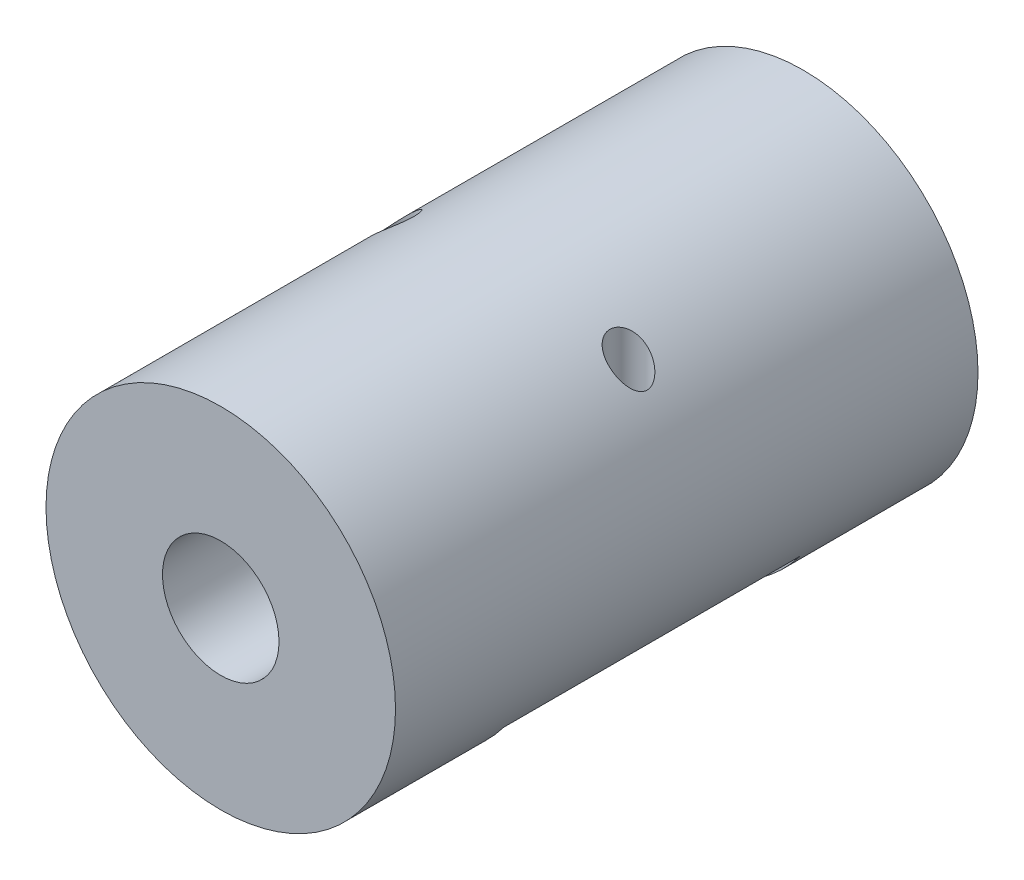
ISO-10303-21;
HEADER;
FILE_DESCRIPTION(('STEP AP214'),'2;1');
FILE_NAME('part.step','',(''),(''),'','','');
FILE_SCHEMA(('AUTOMOTIVE_DESIGN { 1 0 10303 214 1 1 1 1 }'));
ENDSEC;
DATA;
#1=APPLICATION_CONTEXT('core data for automotive mechanical design processes');
#2=APPLICATION_PROTOCOL_DEFINITION('international standard','automotive_design',2000,#1);
#3=PRODUCT_CONTEXT('',#1,'mechanical');
#4=PRODUCT('Part','Part','',(#3));
#5=PRODUCT_RELATED_PRODUCT_CATEGORY('part','',(#4));
#6=PRODUCT_DEFINITION_FORMATION('','',#4);
#7=PRODUCT_DEFINITION_CONTEXT('part definition',#1,'design');
#8=PRODUCT_DEFINITION('design','',#6,#7);
#9=PRODUCT_DEFINITION_SHAPE('','',#8);
#10=(LENGTH_UNIT() NAMED_UNIT(*) SI_UNIT(.MILLI.,.METRE.));
#11=(NAMED_UNIT(*) PLANE_ANGLE_UNIT() SI_UNIT($,.RADIAN.));
#12=(NAMED_UNIT(*) SI_UNIT($,.STERADIAN.) SOLID_ANGLE_UNIT());
#13=UNCERTAINTY_MEASURE_WITH_UNIT(LENGTH_MEASURE(1.E-05),#10,'distance_accuracy_value','');
#14=(GEOMETRIC_REPRESENTATION_CONTEXT(3) GLOBAL_UNCERTAINTY_ASSIGNED_CONTEXT((#13)) GLOBAL_UNIT_ASSIGNED_CONTEXT((#10,
#11,#12)) REPRESENTATION_CONTEXT('',''));
#15=CARTESIAN_POINT('',(0.,0.,0.));
#16=DIRECTION('',(0.,0.,1.));
#17=DIRECTION('',(1.,0.,0.));
#18=AXIS2_PLACEMENT_3D('',#15,#16,#17);
#19=CARTESIAN_POINT('',(0.,0.,25.));
#20=DIRECTION('',(0.,0.,1.));
#21=DIRECTION('',(1.,0.,0.));
#22=AXIS2_PLACEMENT_3D('',#19,#20,#21);
#23=CYLINDRICAL_SURFACE('',#22,15.);
#24=CARTESIAN_POINT('',(-11.6,9.50999474237502,0.));
#25=CARTESIAN_POINT('',(-11.5999925982214,9.51000478479375,0.0680988449643724));
#26=CARTESIAN_POINT('',(-11.5955995566398,9.51537006415514,0.13630180835427));
#27=CARTESIAN_POINT('',(-11.5784855693394,9.5361857383416,0.270126241220068));
#28=CARTESIAN_POINT('',(-11.5657432573677,9.55166200746037,0.335740628411195));
#29=CARTESIAN_POINT('',(-11.5332849408355,9.59082729220467,0.461770868010166));
#30=CARTESIAN_POINT('',(-11.5136424801118,9.61442964671478,0.522233497075484));
#31=CARTESIAN_POINT('',(-11.4686607743886,9.66804263144762,0.637881715568107));
#32=CARTESIAN_POINT('',(-11.4433201092645,9.69805485906551,0.693065984610519));
#33=CARTESIAN_POINT('',(-11.3728240310955,9.78075635008309,0.826935553530318));
#34=CARTESIAN_POINT('',(-11.3244425594717,9.83683094805927,0.901823210291912));
#35=CARTESIAN_POINT('',(-11.2196409976653,9.95620562799633,1.03921748519906));
#36=CARTESIAN_POINT('',(-11.1631988603444,10.0195254290069,1.10168898390595));
#37=CARTESIAN_POINT('',(-11.0184517443475,10.1788850220828,1.2396074457909));
#38=CARTESIAN_POINT('',(-10.9269184595659,10.2772389744453,1.30899389322695));
#39=CARTESIAN_POINT('',(-10.7347172041024,10.4778457170639,1.4257760998047));
#40=CARTESIAN_POINT('',(-10.6340411749736,10.5801018998277,1.473152229611));
#41=CARTESIAN_POINT('',(-10.423434304599,10.7876948240454,1.54707151727154));
#42=CARTESIAN_POINT('',(-10.3133449176977,10.8930486889205,1.57311568910633));
#43=CARTESIAN_POINT('',(-10.0883466426993,11.1017457300064,1.60157231361453));
#44=CARTESIAN_POINT('',(-9.97344115736072,11.2050902527682,1.60400117789178));
#45=CARTESIAN_POINT('',(-9.75715186156156,11.3936730847332,1.58467541400597));
#46=CARTESIAN_POINT('',(-9.65599769834009,11.4794939520277,1.56608795425548));
#47=CARTESIAN_POINT('',(-9.4550627964142,11.6455437114132,1.50796256820385));
#48=CARTESIAN_POINT('',(-9.35528066660579,11.7257786636694,1.46844775977578));
#49=CARTESIAN_POINT('',(-9.18129634884118,11.8622679684376,1.37741070823162));
#50=CARTESIAN_POINT('',(-9.10608902644065,11.9200398739796,1.33009293505086));
#51=CARTESIAN_POINT('',(-8.96175881647537,12.0289240786253,1.2207477297016));
#52=CARTESIAN_POINT('',(-8.8926287977248,12.0800442177679,1.15873786202992));
#53=CARTESIAN_POINT('',(-8.77456046718763,12.1659985439675,1.03175119163399));
#54=CARTESIAN_POINT('',(-8.72417800520905,12.2021268232262,0.968998424346617));
#55=CARTESIAN_POINT('',(-8.6321621547476,12.2673941416698,0.834071917169679));
#56=CARTESIAN_POINT('',(-8.59052623423417,12.296535203926,0.761900913594599));
#57=CARTESIAN_POINT('',(-8.51804501352629,12.3468572194192,0.609098724123263));
#58=CARTESIAN_POINT('',(-8.48726999843997,12.367986387778,0.528416669007282));
#59=CARTESIAN_POINT('',(-8.43893052990896,12.4010211751291,0.361390516503534));
#60=CARTESIAN_POINT('',(-8.42135771267995,12.4129326338186,0.275050041569356));
#61=CARTESIAN_POINT('',(-8.40186909114742,12.426130219492,0.109932175923426));
#62=CARTESIAN_POINT('',(-8.39839158921566,12.428476345961,0.0314200792730841));
#63=CARTESIAN_POINT('',(-8.40297979837881,12.4253748552991,-0.125095070698874));
#64=CARTESIAN_POINT('',(-8.41104167506907,12.4199298270806,-0.203098284465603));
#65=CARTESIAN_POINT('',(-8.43759998646663,12.4019007974743,-0.352736537777699));
#66=CARTESIAN_POINT('',(-8.45560869039248,12.3896503409665,-0.424500078402362));
#67=CARTESIAN_POINT('',(-8.50076724828761,12.3587095044592,-0.563605469600887));
#68=CARTESIAN_POINT('',(-8.52791811064906,12.3400184140439,-0.630946831422954));
#69=CARTESIAN_POINT('',(-8.59167265642953,12.2957201539449,-0.763060196980582));
#70=CARTESIAN_POINT('',(-8.62868147289989,12.2698136314998,-0.827534869362442));
#71=CARTESIAN_POINT('',(-8.70979033324541,12.2123716351644,-0.949053906466059));
#72=CARTESIAN_POINT('',(-8.75389274693194,12.1808342797505,-1.00609577648753));
#73=CARTESIAN_POINT('',(-8.85352877898589,12.1086440431457,-1.11890960142749));
#74=CARTESIAN_POINT('',(-8.90980267422827,12.0673428503582,-1.1736099550183));
#75=CARTESIAN_POINT('',(-9.02728392504349,11.9797136090915,-1.27269099134787));
#76=CARTESIAN_POINT('',(-9.08849523024711,11.9333815257399,-1.31706329979264));
#77=CARTESIAN_POINT('',(-9.24244267462024,11.8148382688205,-1.4133838783521));
#78=CARTESIAN_POINT('',(-9.33695914509652,11.7403708381023,-1.45974145338411));
#79=CARTESIAN_POINT('',(-9.52863493979862,11.5853523022454,-1.53243556634944));
#80=CARTESIAN_POINT('',(-9.62579786420666,11.5047926146423,-1.55874325893637));
#81=CARTESIAN_POINT('',(-9.82114299146873,11.3385104340879,-1.59310179424331));
#82=CARTESIAN_POINT('',(-9.91932134415095,11.2527331078586,-1.6009025320779));
#83=CARTESIAN_POINT('',(-10.113273266319,11.0787503446769,-1.59893146283099));
#84=CARTESIAN_POINT('',(-10.2090461178791,10.990544198925,-1.58915447137976));
#85=CARTESIAN_POINT('',(-10.4166850399835,10.7943120679393,-1.54913846485799));
#86=CARTESIAN_POINT('',(-10.5276123647381,10.6860817356522,-1.51497049491641));
#87=CARTESIAN_POINT('',(-10.7411447177531,10.4714221852125,-1.42275915006419));
#88=CARTESIAN_POINT('',(-10.8437493390436,10.3649930553376,-1.36471460846005));
#89=CARTESIAN_POINT('',(-11.0112307652167,10.1864370764417,-1.24298790641316));
#90=CARTESIAN_POINT('',(-11.0787852881642,10.1128451177744,-1.18511942668339));
#91=CARTESIAN_POINT('',(-11.2060952302414,9.97157920931768,-1.05526470470119));
#92=CARTESIAN_POINT('',(-11.2658654244488,9.90389413099595,-0.983305876663196));
#93=CARTESIAN_POINT('',(-11.3581885185525,9.79769956763222,-0.848417257487912));
#94=CARTESIAN_POINT('',(-11.3934830822265,9.75658726092283,-0.789425650702394));
#95=CARTESIAN_POINT('',(-11.4574913430679,9.6813387567985,-0.663827553184448));
#96=CARTESIAN_POINT('',(-11.4862131319035,9.64719398740052,-0.597230578477356));
#97=CARTESIAN_POINT('',(-11.5299901579119,9.5948029386852,-0.471769916106403));
#98=CARTESIAN_POINT('',(-11.5466503275508,9.57472222488295,-0.414239637822073));
#99=CARTESIAN_POINT('',(-11.5736038195443,9.54212500813552,-0.295699918080323));
#100=CARTESIAN_POINT('',(-11.5839134404265,9.52958914343397,-0.234699825563692));
#101=CARTESIAN_POINT('',(-11.5937427982294,9.51762304105103,-0.144266342660087));
#102=CARTESIAN_POINT('',(-11.5960830660976,9.51477087180676,-0.115546099082405));
#103=CARTESIAN_POINT('',(-11.5992134530783,9.51095432870064,-0.0578902158090507));
#104=CARTESIAN_POINT('',(-11.6000031471156,9.50999047250222,-0.028954519230609));
#105=CARTESIAN_POINT('',(-11.6,9.50999474237502,0.));
#106=B_SPLINE_CURVE_WITH_KNOTS('',3,(#24,#25,#26,#27,#28,#29,#30,#31,#32,#33,#34,#35,#36,#37,
#38,#39,#40,#41,#42,#43,#44,#45,#46,#47,#48,#49,#50,#51,#52,#53,#54,#55,#56,#57,#58,#59,#60,#61,
#62,#63,#64,#65,#66,#67,#68,#69,#70,#71,#72,#73,#74,#75,#76,#77,#78,#79,#80,#81,#82,#83,#84,#85,
#86,#87,#88,#89,#90,#91,#92,#93,#94,#95,#96,#97,#98,#99,#100,#101,#102,#103,#104,#105),
.UNSPECIFIED.,.T.,.F.,(4,2,2,2,2,2,2,2,2,2,2,2,2,2,2,2,2,2,2,2,2,2,2,2,2,2,2,2,2,2,2,2,2,2,2,2,
2,2,2,2,4),(0.,0.204150327636968,0.408825138608906,0.61138153332754,0.813988465854817,
1.12819223155212,1.44327246392442,1.89452294521242,2.34617509374427,2.80811246199375,
3.26972878105092,3.67007313097447,4.06997615101961,4.3867365346221,4.70312012304896,
4.96667882258208,5.23016111921661,5.49531852566042,5.7603078090536,5.99497054116305,
6.2295553156079,6.453544885256,6.67755916934784,6.91278644389419,7.14809246643366,
7.41313709649812,7.67839588995922,8.06313980926915,8.44843621212934,8.83891060794228,
9.22950018903983,9.70362384797424,10.1777706770153,10.5231295669891,10.8678230852102,
11.1074041568611,11.3466886769735,11.5354821778228,11.7237891036779,11.8105667104811,
11.8973681032301),.UNSPECIFIED.);
#107=CARTESIAN_POINT('',(-11.6,9.50999474237502,0.));
#108=VERTEX_POINT('',#107);
#109=EDGE_CURVE('E134',#108,#108,#106,.T.);
#110=ORIENTED_EDGE('',*,*,#109,.F.);
#111=EDGE_LOOP('',(#110));
#112=FACE_BOUND('',#111,.T.);
#113=CARTESIAN_POINT('',(8.4,12.4273891063248,0.));
#114=CARTESIAN_POINT('',(8.40000501006103,12.4273864323887,0.0780335395132181));
#115=CARTESIAN_POINT('',(8.40574774875426,12.4235100308816,0.156165504121463));
#116=CARTESIAN_POINT('',(8.42840512734708,12.4081491345236,0.310109160515021));
#117=CARTESIAN_POINT('',(8.44534148790919,12.3966498477155,0.385916040725357));
#118=CARTESIAN_POINT('',(8.48934713679184,12.3665551396632,0.532705897116737));
#119=CARTESIAN_POINT('',(8.51637860576112,12.3479861985076,0.603705723691785));
#120=CARTESIAN_POINT('',(8.57919099938772,12.3044274739463,0.739530696125875));
#121=CARTESIAN_POINT('',(8.61497047825421,12.2794387515085,0.804356859853805));
#122=CARTESIAN_POINT('',(8.69580776581861,12.2223359235264,0.930031022890248));
#123=CARTESIAN_POINT('',(8.74125731825261,12.1899139605443,0.990485099074101));
#124=CARTESIAN_POINT('',(8.83829695632284,12.1197399142812,1.10270445196467));
#125=CARTESIAN_POINT('',(8.88988930516468,12.0819858655269,1.15446650921429));
#126=CARTESIAN_POINT('',(9.00599192406868,11.9957536448922,1.25651041360136));
#127=CARTESIAN_POINT('',(9.07125972658625,11.9465220022162,1.3052900555671));
#128=CARTESIAN_POINT('',(9.20561071483371,11.8433079031617,1.39115659646975));
#129=CARTESIAN_POINT('',(9.27469742783348,11.7893210264365,1.42823246597624));
#130=CARTESIAN_POINT('',(9.4482293802364,11.6511089991804,1.50611778446109));
#131=CARTESIAN_POINT('',(9.55390047917185,11.5646887713045,1.54035443460607));
#132=CARTESIAN_POINT('',(9.76557437937609,11.3865179812565,1.58644674272066));
#133=CARTESIAN_POINT('',(9.87157742845832,11.2947610155356,1.59827491691371));
#134=CARTESIAN_POINT('',(10.0823414259178,11.1070497467956,1.60139352270251));
#135=CARTESIAN_POINT('',(10.1870715890862,11.0110579682212,1.59243242788286));
#136=CARTESIAN_POINT('',(10.392016417595,10.8178480236531,1.55473409339015));
#137=CARTESIAN_POINT('',(10.4922250431935,10.7206284270918,1.52597119040023));
#138=CARTESIAN_POINT('',(10.6457314729924,10.5676308587971,1.46517280611132));
#139=CARTESIAN_POINT('',(10.7012024415749,10.5114376417781,1.43947633525288));
#140=CARTESIAN_POINT('',(10.8095877514249,10.3999445522323,1.38143007831341));
#141=CARTESIAN_POINT('',(10.8625010887007,10.3446450361052,1.34907770525211));
#142=CARTESIAN_POINT('',(10.9651732613713,10.2357493354301,1.27763249635676));
#143=CARTESIAN_POINT('',(11.0149387265439,10.1821496982097,1.23855451890777));
#144=CARTESIAN_POINT('',(11.1108227039199,10.0774327539105,1.15333560107726));
#145=CARTESIAN_POINT('',(11.1569445284109,10.0263132089828,1.10720119011668));
#146=CARTESIAN_POINT('',(11.2472959518478,9.92487778062165,1.00458534899935));
#147=CARTESIAN_POINT('',(11.2912695578093,9.87477220444364,0.947665253375463));
#148=CARTESIAN_POINT('',(11.3729033784788,9.78064092161109,0.824955011752293));
#149=CARTESIAN_POINT('',(11.41057318591,9.73660599535306,0.759178623125741));
#150=CARTESIAN_POINT('',(11.4707880161794,9.66554378779925,0.632946353575663));
#151=CARTESIAN_POINT('',(11.4948507341616,9.63687985998682,0.57415029726972));
#152=CARTESIAN_POINT('',(11.5364103947229,9.58708983418451,0.451254995664603));
#153=CARTESIAN_POINT('',(11.5539162876033,9.56595346276278,0.387163126384852));
#154=CARTESIAN_POINT('',(11.5788771003766,9.53571870379198,0.265306503987981));
#155=CARTESIAN_POINT('',(11.5874755462278,9.52525487055583,0.20811923328253));
#156=CARTESIAN_POINT('',(11.5983934519584,9.51195813140747,0.092278395913196));
#157=CARTESIAN_POINT('',(11.6007169589104,9.50912030704493,0.0336257989744889));
#158=CARTESIAN_POINT('',(11.5988950959715,9.51134237139937,-0.0834524943068132));
#159=CARTESIAN_POINT('',(11.5947465835119,9.51640609681128,-0.141878066603561));
#160=CARTESIAN_POINT('',(11.580318431115,9.53395772180998,-0.256822529286114));
#161=CARTESIAN_POINT('',(11.5700343474282,9.54645100230599,-0.313340006337129));
#162=CARTESIAN_POINT('',(11.540809828646,9.58177171261287,-0.43688967344468));
#163=CARTESIAN_POINT('',(11.5203533829918,9.60639565839772,-0.503044824428059));
#164=CARTESIAN_POINT('',(11.4726144837359,9.66335858719212,-0.629272897523933));
#165=CARTESIAN_POINT('',(11.4453197536963,9.69571144062564,-0.689334604949627));
#166=CARTESIAN_POINT('',(11.372477050616,9.78115993152418,-0.827499294818293));
#167=CARTESIAN_POINT('',(11.3241222472107,9.83719934510696,-0.902285176503839));
#168=CARTESIAN_POINT('',(11.2194237371596,9.95644950183978,-1.03945989014257));
#169=CARTESIAN_POINT('',(11.1630633404933,10.0196751703977,-1.1018221518089));
#170=CARTESIAN_POINT('',(11.0184065511493,10.1789340073445,-1.23964470052813));
#171=CARTESIAN_POINT('',(10.9268728256456,10.2772875099121,-1.30902615591818));
#172=CARTESIAN_POINT('',(10.7346586354243,10.4779059357173,-1.42580714750543));
#173=CARTESIAN_POINT('',(10.6339689523012,10.5801747396352,-1.47318422955666));
#174=CARTESIAN_POINT('',(10.4233429455032,10.7877831873615,-1.54709678056997));
#175=CARTESIAN_POINT('',(10.3132486905799,10.8931398690463,-1.57313514050557));
#176=CARTESIAN_POINT('',(10.0882419440201,11.1018409207552,-1.60157827887548));
#177=CARTESIAN_POINT('',(9.97333289149169,11.2051866524208,-1.60399964688264));
#178=CARTESIAN_POINT('',(9.75704430588523,11.3937651209601,-1.58465873553458));
#179=CARTESIAN_POINT('',(9.65589437415398,11.4795807825184,-1.56606506991856));
#180=CARTESIAN_POINT('',(9.4549688640736,11.6456198968177,-1.50792840395435));
#181=CARTESIAN_POINT('',(9.3551918940421,11.7258494078726,-1.468408512022));
#182=CARTESIAN_POINT('',(9.18121425160337,11.8623314944381,-1.37736203797725));
#183=CARTESIAN_POINT('',(9.10600842631398,11.9201014224836,-1.33003900210567));
#184=CARTESIAN_POINT('',(8.96168748805932,12.0289771492069,-1.22068657729978));
#185=CARTESIAN_POINT('',(8.89256481359634,12.0800912602592,-1.15867581007425));
#186=CARTESIAN_POINT('',(8.77451914188441,12.1660282418925,-1.03170110154618));
#187=CARTESIAN_POINT('',(8.72415087521281,12.2021461427756,-0.968962329558952));
#188=CARTESIAN_POINT('',(8.63213910719579,12.2674104133589,-0.834034436848432));
#189=CARTESIAN_POINT('',(8.59049687028529,12.2965557727977,-0.76184394899466));
#190=CARTESIAN_POINT('',(8.51797829632273,12.3469033548838,-0.608953095268276));
#191=CARTESIAN_POINT('',(8.48718167395217,12.3680468455376,-0.52819517337348));
#192=CARTESIAN_POINT('',(8.43887616911714,12.4010582205576,-0.361119067808462));
#193=CARTESIAN_POINT('',(8.42133099754205,12.4129514394858,-0.274816776767866));
#194=CARTESIAN_POINT('',(8.40735050236986,12.4224179850055,-0.156375989937393));
#195=CARTESIAN_POINT('',(8.40459836550588,12.4242798941452,-0.125198568336057));
#196=CARTESIAN_POINT('',(8.40092212025064,12.4267659835816,-0.0626860587727466));
#197=CARTESIAN_POINT('',(8.39999798714388,12.4273901806128,-0.0313509729482118));
#198=CARTESIAN_POINT('',(8.4,12.4273891063248,0.));
#199=B_SPLINE_CURVE_WITH_KNOTS('',3,(#113,#114,#115,#116,#117,#118,#119,#120,#121,#122,#123,
#124,#125,#126,#127,#128,#129,#130,#131,#132,#133,#134,#135,#136,#137,#138,#139,#140,#141,#142,
#143,#144,#145,#146,#147,#148,#149,#150,#151,#152,#153,#154,#155,#156,#157,#158,#159,#160,#161,
#162,#163,#164,#165,#166,#167,#168,#169,#170,#171,#172,#173,#174,#175,#176,#177,#178,#179,#180,
#181,#182,#183,#184,#185,#186,#187,#188,#189,#190,#191,#192,#193,#194,#195,#196,#197,#198),
.UNSPECIFIED.,.T.,.F.,(4,2,2,2,2,2,2,2,2,2,2,2,2,2,2,2,2,2,2,2,2,2,2,2,2,2,2,2,2,2,2,2,2,2,2,2,
2,2,2,2,2,2,4),(0.,0.233971814542686,0.468398977898754,0.701956574715617,0.935475597336678,
1.18139228924052,1.42739986684405,1.71194633324149,1.99676015621575,2.41668862218282,
2.83713179371065,3.26268833118225,3.68879743447302,3.93764476038661,4.18658899028993,
4.43499014464942,4.68316282497368,4.94542177588173,5.20727793519904,5.41561991148949,
5.62367644797957,5.7992036391575,5.97461759558571,6.15011675293097,6.32574317188197,
6.54501139565279,6.76467611758698,7.07859661970665,7.39318145857598,7.84442689479301,
8.29613179372164,8.75808236774915,9.21970842478834,9.62003587084746,10.0199221623789,
10.3366831973036,10.6530447592119,10.9165395803175,11.1800725564629,11.4455039315642,
11.7102057603781,11.8042082015362,11.898209371727),.UNSPECIFIED.);
#200=CARTESIAN_POINT('',(8.4,12.4273891063248,0.));
#201=VERTEX_POINT('',#200);
#202=EDGE_CURVE('E71',#201,#201,#199,.T.);
#203=ORIENTED_EDGE('',*,*,#202,.F.);
#204=EDGE_LOOP('',(#203));
#205=FACE_BOUND('',#204,.T.);
#206=CARTESIAN_POINT('',(0.,0.,25.));
#207=DIRECTION('',(0.,0.,1.));
#208=DIRECTION('',(1.,0.,0.));
#209=AXIS2_PLACEMENT_3D('',#206,#207,#208);
#210=CIRCLE('',#209,15.);
#211=CARTESIAN_POINT('',(15.,0.,25.));
#212=VERTEX_POINT('',#211);
#213=EDGE_CURVE('E83',#212,#212,#210,.T.);
#214=ORIENTED_EDGE('',*,*,#213,.F.);
#215=EDGE_LOOP('',(#214));
#216=FACE_BOUND('',#215,.T.);
#217=CARTESIAN_POINT('',(0.,0.,-25.));
#218=DIRECTION('',(0.,0.,1.));
#219=DIRECTION('',(1.,0.,0.));
#220=AXIS2_PLACEMENT_3D('',#217,#218,#219);
#221=CIRCLE('',#220,15.);
#222=CARTESIAN_POINT('',(15.,0.,-25.));
#223=VERTEX_POINT('',#222);
#224=EDGE_CURVE('E67',#223,#223,#221,.T.);
#225=ORIENTED_EDGE('',*,*,#224,.T.);
#226=EDGE_LOOP('',(#225));
#227=FACE_BOUND('',#226,.T.);
#228=DIRECTION('',(0.,0.,1.));
#229=VECTOR('',#228,1.);
#230=CARTESIAN_POINT('',(-12.,-9.,25.));
#231=LINE('',#230,#229);
#232=CARTESIAN_POINT('',(-12.,-9.,-12.7));
#233=VERTEX_POINT('',#232);
#234=CARTESIAN_POINT('',(-12.,-9.,12.7));
#235=VERTEX_POINT('',#234);
#236=EDGE_CURVE('E66',#233,#235,#231,.T.);
#237=ORIENTED_EDGE('',*,*,#236,.T.);
#238=CARTESIAN_POINT('',(0.,0.,12.7));
#239=DIRECTION('',(0.,0.,-1.));
#240=DIRECTION('',(-1.,0.,0.));
#241=AXIS2_PLACEMENT_3D('',#238,#239,#240);
#242=CIRCLE('',#241,15.);
#243=CARTESIAN_POINT('',(12.,-9.,12.7));
#244=VERTEX_POINT('',#243);
#245=EDGE_CURVE('E11',#235,#244,#242,.F.);
#246=ORIENTED_EDGE('',*,*,#245,.T.);
#247=DIRECTION('',(0.,0.,1.));
#248=VECTOR('',#247,1.);
#249=CARTESIAN_POINT('',(12.,-9.,25.));
#250=LINE('',#249,#248);
#251=CARTESIAN_POINT('',(12.,-9.,-12.7));
#252=VERTEX_POINT('',#251);
#253=EDGE_CURVE('E42',#244,#252,#250,.F.);
#254=ORIENTED_EDGE('',*,*,#253,.T.);
#255=CARTESIAN_POINT('',(0.,0.,-12.7));
#256=DIRECTION('',(0.,0.,-1.));
#257=DIRECTION('',(-1.,0.,0.));
#258=AXIS2_PLACEMENT_3D('',#255,#256,#257);
#259=CIRCLE('',#258,15.);
#260=EDGE_CURVE('E60',#233,#252,#259,.F.);
#261=ORIENTED_EDGE('',*,*,#260,.F.);
#262=EDGE_LOOP('',(#237,#246,#254,#261));
#263=FACE_BOUND('',#262,.T.);
#264=ADVANCED_FACE('F34',(#112,#205,#216,#227,#263),#23,.T.);
#265=CARTESIAN_POINT('',(15.,0.,-25.));
#266=DIRECTION('',(0.,0.,-1.));
#267=DIRECTION('',(-1.,0.,0.));
#268=AXIS2_PLACEMENT_3D('',#265,#266,#267);
#269=PLANE('',#268);
#270=CARTESIAN_POINT('',(0.,0.,-25.));
#271=DIRECTION('',(0.,0.,1.));
#272=DIRECTION('',(1.,0.,0.));
#273=AXIS2_PLACEMENT_3D('',#270,#271,#272);
#274=CIRCLE('',#273,5.);
#275=CARTESIAN_POINT('',(5.,0.,-25.));
#276=VERTEX_POINT('',#275);
#277=EDGE_CURVE('E77',#276,#276,#274,.T.);
#278=ORIENTED_EDGE('',*,*,#277,.T.);
#279=EDGE_LOOP('',(#278));
#280=FACE_BOUND('',#279,.T.);
#281=ORIENTED_EDGE('',*,*,#224,.F.);
#282=EDGE_LOOP('',(#281));
#283=FACE_BOUND('',#282,.T.);
#284=ADVANCED_FACE('F116',(#280,#283),#269,.T.);
#285=CARTESIAN_POINT('',(0.,0.,25.));
#286=DIRECTION('',(0.,0.,1.));
#287=DIRECTION('',(1.,0.,0.));
#288=AXIS2_PLACEMENT_3D('',#285,#286,#287);
#289=CYLINDRICAL_SURFACE('',#288,5.);
#290=CARTESIAN_POINT('',(0.,0.,25.));
#291=DIRECTION('',(0.,0.,1.));
#292=DIRECTION('',(1.,0.,0.));
#293=AXIS2_PLACEMENT_3D('',#290,#291,#292);
#294=CIRCLE('',#293,5.);
#295=CARTESIAN_POINT('',(5.,0.,25.));
#296=VERTEX_POINT('',#295);
#297=EDGE_CURVE('E80',#296,#296,#294,.T.);
#298=ORIENTED_EDGE('',*,*,#297,.T.);
#299=EDGE_LOOP('',(#298));
#300=FACE_BOUND('',#299,.T.);
#301=ORIENTED_EDGE('',*,*,#277,.F.);
#302=EDGE_LOOP('',(#301));
#303=FACE_BOUND('',#302,.T.);
#304=ADVANCED_FACE('F113',(#300,#303),#289,.F.);
#305=CARTESIAN_POINT('',(15.,0.,25.));
#306=DIRECTION('',(0.,0.,1.));
#307=DIRECTION('',(1.,0.,0.));
#308=AXIS2_PLACEMENT_3D('',#305,#306,#307);
#309=PLANE('',#308);
#310=ORIENTED_EDGE('',*,*,#213,.T.);
#311=EDGE_LOOP('',(#310));
#312=FACE_BOUND('',#311,.T.);
#313=ORIENTED_EDGE('',*,*,#297,.F.);
#314=EDGE_LOOP('',(#313));
#315=FACE_BOUND('',#314,.T.);
#316=ADVANCED_FACE('F109',(#312,#315),#309,.T.);
#317=CARTESIAN_POINT('',(-15.,-9.,12.7));
#318=DIRECTION('',(0.,-1.,0.));
#319=DIRECTION('',(0.,0.,-1.));
#320=AXIS2_PLACEMENT_3D('',#317,#318,#319);
#321=PLANE('',#320);
#322=CARTESIAN_POINT('',(-10.,-9.,0.));
#323=DIRECTION('',(0.,1.,0.));
#324=DIRECTION('',(-1.,0.,0.));
#325=AXIS2_PLACEMENT_3D('',#322,#323,#324);
#326=CIRCLE('',#325,1.6);
#327=CARTESIAN_POINT('',(-11.6,-9.,0.));
#328=VERTEX_POINT('',#327);
#329=EDGE_CURVE('E144',#328,#328,#326,.T.);
#330=ORIENTED_EDGE('',*,*,#329,.T.);
#331=EDGE_LOOP('',(#330));
#332=FACE_BOUND('',#331,.T.);
#333=CARTESIAN_POINT('',(10.,-9.,0.));
#334=DIRECTION('',(0.,1.,0.));
#335=DIRECTION('',(-1.,0.,0.));
#336=AXIS2_PLACEMENT_3D('',#333,#334,#335);
#337=CIRCLE('',#336,1.6);
#338=CARTESIAN_POINT('',(8.4,-9.,0.));
#339=VERTEX_POINT('',#338);
#340=EDGE_CURVE('E92',#339,#339,#337,.T.);
#341=ORIENTED_EDGE('',*,*,#340,.T.);
#342=EDGE_LOOP('',(#341));
#343=FACE_BOUND('',#342,.T.);
#344=DIRECTION('',(-1.,0.,0.));
#345=VECTOR('',#344,1.);
#346=CARTESIAN_POINT('',(-15.,-9.,12.7));
#347=LINE('',#346,#345);
#348=EDGE_CURVE('E70',#244,#235,#347,.T.);
#349=ORIENTED_EDGE('',*,*,#348,.T.);
#350=ORIENTED_EDGE('',*,*,#236,.F.);
#351=DIRECTION('',(-1.,0.,0.));
#352=VECTOR('',#351,1.);
#353=CARTESIAN_POINT('',(-15.,-9.,-12.7));
#354=LINE('',#353,#352);
#355=EDGE_CURVE('E62',#252,#233,#354,.T.);
#356=ORIENTED_EDGE('',*,*,#355,.F.);
#357=ORIENTED_EDGE('',*,*,#253,.F.);
#358=EDGE_LOOP('',(#349,#350,#356,#357));
#359=FACE_BOUND('',#358,.T.);
#360=ADVANCED_FACE('F69',(#332,#343,#359),#321,.T.);
#361=CARTESIAN_POINT('',(-15.,-9.,12.7));
#362=DIRECTION('',(0.,0.,-1.));
#363=DIRECTION('',(-1.,0.,0.));
#364=AXIS2_PLACEMENT_3D('',#361,#362,#363);
#365=PLANE('',#364);
#366=ORIENTED_EDGE('',*,*,#348,.F.);
#367=ORIENTED_EDGE('',*,*,#245,.F.);
#368=EDGE_LOOP('',(#366,#367));
#369=FACE_BOUND('',#368,.T.);
#370=ADVANCED_FACE('F104',(#369),#365,.T.);
#371=CARTESIAN_POINT('',(-15.,-9.,-12.7));
#372=DIRECTION('',(0.,0.,-1.));
#373=DIRECTION('',(-1.,0.,0.));
#374=AXIS2_PLACEMENT_3D('',#371,#372,#373);
#375=PLANE('',#374);
#376=ORIENTED_EDGE('',*,*,#355,.T.);
#377=ORIENTED_EDGE('',*,*,#260,.T.);
#378=EDGE_LOOP('',(#376,#377));
#379=FACE_BOUND('',#378,.T.);
#380=ADVANCED_FACE('F61',(#379),#375,.F.);
#381=CARTESIAN_POINT('',(10.,-9.,0.));
#382=DIRECTION('',(0.,1.,0.));
#383=DIRECTION('',(-1.,0.,0.));
#384=AXIS2_PLACEMENT_3D('',#381,#382,#383);
#385=CYLINDRICAL_SURFACE('',#384,1.59999999999999);
#386=ORIENTED_EDGE('',*,*,#202,.T.);
#387=EDGE_LOOP('',(#386));
#388=FACE_BOUND('',#387,.T.);
#389=ORIENTED_EDGE('',*,*,#340,.F.);
#390=EDGE_LOOP('',(#389));
#391=FACE_BOUND('',#390,.T.);
#392=ADVANCED_FACE('F94',(#388,#391),#385,.F.);
#393=CARTESIAN_POINT('',(-10.,-9.,0.));
#394=DIRECTION('',(0.,1.,0.));
#395=DIRECTION('',(-1.,0.,0.));
#396=AXIS2_PLACEMENT_3D('',#393,#394,#395);
#397=CYLINDRICAL_SURFACE('',#396,1.59999999999999);
#398=ORIENTED_EDGE('',*,*,#109,.T.);
#399=EDGE_LOOP('',(#398));
#400=FACE_BOUND('',#399,.T.);
#401=ORIENTED_EDGE('',*,*,#329,.F.);
#402=EDGE_LOOP('',(#401));
#403=FACE_BOUND('',#402,.T.);
#404=ADVANCED_FACE('F99',(#400,#403),#397,.F.);
#405=CLOSED_SHELL('',(#264,#284,#304,#316,#360,#370,#380,#392,#404));
#406=MANIFOLD_SOLID_BREP('B2',#405);
#407=ADVANCED_BREP_SHAPE_REPRESENTATION('',(#18,#406),#14);
#408=SHAPE_DEFINITION_REPRESENTATION(#9,#407);
ENDSEC;
END-ISO-10303-21;
